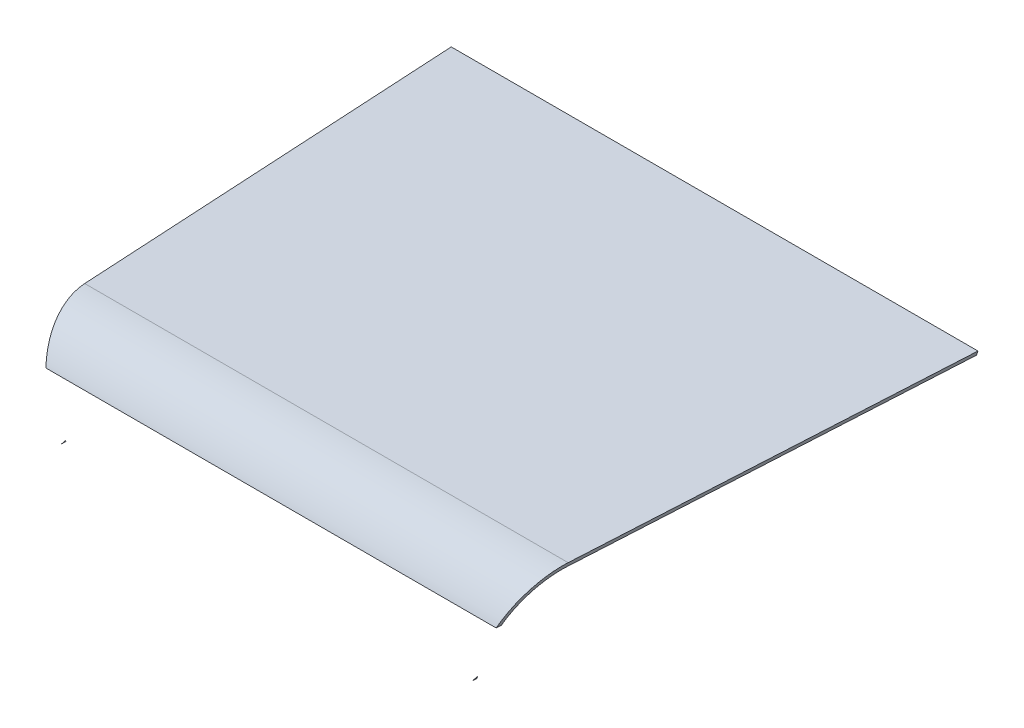
ISO-10303-21;
HEADER;
FILE_DESCRIPTION(('STEP AP214'),'2;1');
FILE_NAME('part.step','',(''),(''),'','','');
FILE_SCHEMA(('AUTOMOTIVE_DESIGN { 1 0 10303 214 1 1 1 1 }'));
ENDSEC;
DATA;
#1=APPLICATION_CONTEXT('core data for automotive mechanical design processes');
#2=APPLICATION_PROTOCOL_DEFINITION('international standard','automotive_design',2000,#1);
#3=PRODUCT_CONTEXT('',#1,'mechanical');
#4=PRODUCT('Part','Part','',(#3));
#5=PRODUCT_RELATED_PRODUCT_CATEGORY('part','',(#4));
#6=PRODUCT_DEFINITION_FORMATION('','',#4);
#7=PRODUCT_DEFINITION_CONTEXT('part definition',#1,'design');
#8=PRODUCT_DEFINITION('design','',#6,#7);
#9=PRODUCT_DEFINITION_SHAPE('','',#8);
#10=(LENGTH_UNIT() NAMED_UNIT(*) SI_UNIT(.MILLI.,.METRE.));
#11=(NAMED_UNIT(*) PLANE_ANGLE_UNIT() SI_UNIT($,.RADIAN.));
#12=(NAMED_UNIT(*) SI_UNIT($,.STERADIAN.) SOLID_ANGLE_UNIT());
#13=UNCERTAINTY_MEASURE_WITH_UNIT(LENGTH_MEASURE(1.E-05),#10,'distance_accuracy_value','');
#14=(GEOMETRIC_REPRESENTATION_CONTEXT(3) GLOBAL_UNCERTAINTY_ASSIGNED_CONTEXT((#13)) GLOBAL_UNIT_ASSIGNED_CONTEXT((#10,
#11,#12)) REPRESENTATION_CONTEXT('',''));
#15=CARTESIAN_POINT('',(0.,0.,0.));
#16=DIRECTION('',(0.,0.,1.));
#17=DIRECTION('',(1.,0.,0.));
#18=AXIS2_PLACEMENT_3D('',#15,#16,#17);
#19=CARTESIAN_POINT('',(60.4743505347116,-22.0108635312157,3.37272672467917));
#20=DIRECTION('',(-0.938404804707736,0.341551416606009,-0.0523359562429439));
#21=DIRECTION('',(-0.342020143325672,-0.939692620785907,0.));
#22=AXIS2_PLACEMENT_3D('',#19,#20,#21);
#23=PLANE('',#22);
#24=CARTESIAN_POINT('',(147.338347635043,210.,-40.));
#25=DIRECTION('',(-0.938404804707736,0.341551416606009,-0.0523359562429439));
#26=DIRECTION('',(0.345537874192446,0.927578463422807,-0.1421329366922));
#27=AXIS2_PLACEMENT_3D('',#24,#25,#26);
#28=ELLIPSE('',#27,42.6255277033219,40.);
#29=CARTESIAN_POINT('',(161.897157005691,250.,-40.0000000000001));
#30=VERTEX_POINT('',#29);
#31=CARTESIAN_POINT('',(150.752490442653,225.058565854795,-2.9427524713886));
#32=VERTEX_POINT('',#31);
#33=EDGE_CURVE('E275',#30,#32,#28,.F.);
#34=ORIENTED_EDGE('',*,*,#33,.T.);
#35=DIRECTION('',(0.0556846595471102,0.,-0.998448405623006));
#36=VECTOR('',#35,1.);
#37=CARTESIAN_POINT('',(150.121428022348,225.058565854795,8.37245125844471));
#38=LINE('',#37,#36);
#39=CARTESIAN_POINT('',(150.934316371297,225.058565854795,-6.20296470995162));
#40=VERTEX_POINT('',#39);
#41=EDGE_CURVE('E76',#32,#40,#38,.T.);
#42=ORIENTED_EDGE('',*,*,#41,.T.);
#43=CARTESIAN_POINT('',(147.338347635043,210.,-40.));
#44=DIRECTION('',(-0.938404804707736,0.341551416606009,-0.0523359562429439));
#45=DIRECTION('',(0.345537874192446,0.927578463422807,-0.1421329366922));
#46=AXIS2_PLACEMENT_3D('',#43,#44,#45);
#47=ELLIPSE('',#46,39.4286131255728,37.);
#48=CARTESIAN_POINT('',(160.805246302893,247.,-40.0000000000001));
#49=VERTEX_POINT('',#48);
#50=EDGE_CURVE('E288',#49,#40,#47,.F.);
#51=ORIENTED_EDGE('',*,*,#50,.F.);
#52=DIRECTION('',(-0.0556846595471103,0.,0.998448405623006));
#53=VECTOR('',#52,1.);
#54=CARTESIAN_POINT('',(158.082694019088,247.,8.81646056738436));
#55=LINE('',#54,#53);
#56=CARTESIAN_POINT('',(175.30575669553,247.,-300.));
#57=VERTEX_POINT('',#56);
#58=EDGE_CURVE('E134',#57,#49,#55,.T.);
#59=ORIENTED_EDGE('',*,*,#58,.F.);
#60=DIRECTION('',(0.342020143325673,0.939692620785907,0.));
#61=VECTOR('',#60,1.);
#62=CARTESIAN_POINT('',(154.231358145351,189.098565854796,-300.));
#63=LINE('',#62,#61);
#64=CARTESIAN_POINT('',(176.397667398329,250.,-300.));
#65=VERTEX_POINT('',#64);
#66=EDGE_CURVE('E127',#57,#65,#63,.T.);
#67=ORIENTED_EDGE('',*,*,#66,.T.);
#68=DIRECTION('',(-0.0556846595471103,0.,0.998448405623006));
#69=VECTOR('',#68,1.);
#70=CARTESIAN_POINT('',(176.397667398329,250.,-300.));
#71=LINE('',#70,#69);
#72=EDGE_CURVE('E131',#65,#30,#71,.T.);
#73=ORIENTED_EDGE('',*,*,#72,.T.);
#74=EDGE_LOOP('',(#34,#42,#51,#59,#67,#73));
#75=FACE_BOUND('',#74,.T.);
#76=ADVANCED_FACE('F59',(#75),#23,.F.);
#77=CARTESIAN_POINT('',(0.,0.,-300.));
#78=DIRECTION('',(0.,0.,1.));
#79=DIRECTION('',(1.,0.,0.));
#80=AXIS2_PLACEMENT_3D('',#77,#78,#79);
#81=PLANE('',#80);
#82=ORIENTED_EDGE('',*,*,#66,.F.);
#83=DIRECTION('',(-1.,0.,0.));
#84=VECTOR('',#83,1.);
#85=CARTESIAN_POINT('',(0.,247.,-300.));
#86=LINE('',#85,#84);
#87=CARTESIAN_POINT('',(-175.30575669553,247.,-300.));
#88=VERTEX_POINT('',#87);
#89=EDGE_CURVE('E153',#57,#88,#86,.T.);
#90=ORIENTED_EDGE('',*,*,#89,.T.);
#91=DIRECTION('',(0.342020143325673,-0.939692620785907,0.));
#92=VECTOR('',#91,1.);
#93=CARTESIAN_POINT('',(-176.397667398329,250.,-300.));
#94=LINE('',#93,#92);
#95=CARTESIAN_POINT('',(-176.397667398329,250.,-300.));
#96=VERTEX_POINT('',#95);
#97=EDGE_CURVE('E146',#96,#88,#94,.T.);
#98=ORIENTED_EDGE('',*,*,#97,.F.);
#99=DIRECTION('',(-1.,0.,0.));
#100=VECTOR('',#99,1.);
#101=CARTESIAN_POINT('',(176.397667398329,250.,-300.));
#102=LINE('',#101,#100);
#103=EDGE_CURVE('E142',#65,#96,#102,.T.);
#104=ORIENTED_EDGE('',*,*,#103,.F.);
#105=EDGE_LOOP('',(#82,#90,#98,#104));
#106=FACE_BOUND('',#105,.T.);
#107=ADVANCED_FACE('F144',(#106),#81,.F.);
#108=CARTESIAN_POINT('',(-60.4743505347116,-22.0108635312157,3.37272672467917));
#109=DIRECTION('',(0.938404804707736,0.341551416606009,-0.0523359562429439));
#110=DIRECTION('',(-0.342020143325672,0.939692620785907,0.));
#111=AXIS2_PLACEMENT_3D('',#108,#109,#110);
#112=PLANE('',#111);
#113=CARTESIAN_POINT('',(-147.338347635043,210.,-40.));
#114=DIRECTION('',(0.938404804707736,0.341551416606009,-0.0523359562429439));
#115=DIRECTION('',(0.345537874192446,-0.927578463422807,0.1421329366922));
#116=AXIS2_PLACEMENT_3D('',#113,#114,#115);
#117=ELLIPSE('',#116,39.4286131255728,37.);
#118=CARTESIAN_POINT('',(-150.934316371297,225.058565854795,-6.20296470995162));
#119=VERTEX_POINT('',#118);
#120=CARTESIAN_POINT('',(-160.805246302893,247.,-40.0000000000001));
#121=VERTEX_POINT('',#120);
#122=EDGE_CURVE('E287',#119,#121,#117,.F.);
#123=ORIENTED_EDGE('',*,*,#122,.F.);
#124=DIRECTION('',(0.0556846595471102,0.,0.998448405623006));
#125=VECTOR('',#124,1.);
#126=CARTESIAN_POINT('',(-150.121428022348,225.058565854795,8.3724512584447));
#127=LINE('',#126,#125);
#128=CARTESIAN_POINT('',(-150.752490442653,225.058565854795,-2.94275247138857));
#129=VERTEX_POINT('',#128);
#130=EDGE_CURVE('E63',#119,#129,#127,.T.);
#131=ORIENTED_EDGE('',*,*,#130,.T.);
#132=CARTESIAN_POINT('',(-147.338347635043,210.,-40.));
#133=DIRECTION('',(0.938404804707736,0.341551416606009,-0.0523359562429439));
#134=DIRECTION('',(0.345537874192446,-0.927578463422807,0.1421329366922));
#135=AXIS2_PLACEMENT_3D('',#132,#133,#134);
#136=ELLIPSE('',#135,42.6255277033219,40.);
#137=CARTESIAN_POINT('',(-161.897157005691,250.,-40.0000000000001));
#138=VERTEX_POINT('',#137);
#139=EDGE_CURVE('E122',#129,#138,#136,.F.);
#140=ORIENTED_EDGE('',*,*,#139,.T.);
#141=DIRECTION('',(0.0556846595471103,0.,0.998448405623006));
#142=VECTOR('',#141,1.);
#143=CARTESIAN_POINT('',(-176.397667398329,250.,-300.));
#144=LINE('',#143,#142);
#145=EDGE_CURVE('E280',#96,#138,#144,.T.);
#146=ORIENTED_EDGE('',*,*,#145,.F.);
#147=ORIENTED_EDGE('',*,*,#97,.T.);
#148=DIRECTION('',(0.0556846595471103,0.,0.998448405623006));
#149=VECTOR('',#148,1.);
#150=CARTESIAN_POINT('',(-158.082694019088,247.,8.81646056738437));
#151=LINE('',#150,#149);
#152=EDGE_CURVE('E105',#88,#121,#151,.T.);
#153=ORIENTED_EDGE('',*,*,#152,.T.);
#154=EDGE_LOOP('',(#123,#131,#140,#146,#147,#153));
#155=FACE_BOUND('',#154,.T.);
#156=ADVANCED_FACE('F174',(#155),#112,.F.);
#157=CARTESIAN_POINT('',(0.,250.,0.));
#158=DIRECTION('',(0.,-1.,0.));
#159=DIRECTION('',(0.,0.,-1.));
#160=AXIS2_PLACEMENT_3D('',#157,#158,#159);
#161=PLANE('',#160);
#162=ORIENTED_EDGE('',*,*,#145,.T.);
#163=DIRECTION('',(-1.,0.,0.));
#164=VECTOR('',#163,1.);
#165=CARTESIAN_POINT('',(159.666309252978,250.,-40.));
#166=LINE('',#165,#164);
#167=EDGE_CURVE('E114',#138,#30,#166,.F.);
#168=ORIENTED_EDGE('',*,*,#167,.T.);
#169=ORIENTED_EDGE('',*,*,#72,.F.);
#170=ORIENTED_EDGE('',*,*,#103,.T.);
#171=EDGE_LOOP('',(#162,#168,#169,#170));
#172=FACE_BOUND('',#171,.T.);
#173=ADVANCED_FACE('F152',(#172),#161,.F.);
#174=CARTESIAN_POINT('',(0.,210.,-40.));
#175=DIRECTION('',(1.,0.,0.));
#176=DIRECTION('',(0.,0.,-1.));
#177=AXIS2_PLACEMENT_3D('',#174,#175,#176);
#178=CYLINDRICAL_SURFACE('',#177,40.);
#179=DIRECTION('',(1.,0.,0.));
#180=VECTOR('',#179,1.);
#181=CARTESIAN_POINT('',(0.,225.058565854795,-2.94275247138859));
#182=LINE('',#181,#180);
#183=EDGE_CURVE('E13',#32,#129,#182,.F.);
#184=ORIENTED_EDGE('',*,*,#183,.F.);
#185=ORIENTED_EDGE('',*,*,#33,.F.);
#186=ORIENTED_EDGE('',*,*,#167,.F.);
#187=ORIENTED_EDGE('',*,*,#139,.F.);
#188=EDGE_LOOP('',(#184,#185,#186,#187));
#189=FACE_BOUND('',#188,.T.);
#190=ADVANCED_FACE('F173',(#189),#178,.T.);
#191=CARTESIAN_POINT('',(0.,247.,0.));
#192=DIRECTION('',(0.,-1.,0.));
#193=DIRECTION('',(0.,0.,-1.));
#194=AXIS2_PLACEMENT_3D('',#191,#192,#193);
#195=PLANE('',#194);
#196=ORIENTED_EDGE('',*,*,#152,.F.);
#197=ORIENTED_EDGE('',*,*,#89,.F.);
#198=ORIENTED_EDGE('',*,*,#58,.T.);
#199=DIRECTION('',(1.,0.,0.));
#200=VECTOR('',#199,1.);
#201=CARTESIAN_POINT('',(0.,247.,-40.0000000000001));
#202=LINE('',#201,#200);
#203=EDGE_CURVE('E69',#121,#49,#202,.T.);
#204=ORIENTED_EDGE('',*,*,#203,.F.);
#205=EDGE_LOOP('',(#196,#197,#198,#204));
#206=FACE_BOUND('',#205,.T.);
#207=ADVANCED_FACE('F221',(#206),#195,.T.);
#208=CARTESIAN_POINT('',(0.,210.,-40.));
#209=DIRECTION('',(1.,0.,0.));
#210=DIRECTION('',(0.,0.,-1.));
#211=AXIS2_PLACEMENT_3D('',#208,#209,#210);
#212=CYLINDRICAL_SURFACE('',#211,37.);
#213=ORIENTED_EDGE('',*,*,#50,.T.);
#214=DIRECTION('',(1.,0.,0.));
#215=VECTOR('',#214,1.);
#216=CARTESIAN_POINT('',(0.,225.058565854795,-6.20296470995162));
#217=LINE('',#216,#215);
#218=EDGE_CURVE('E285',#40,#119,#217,.F.);
#219=ORIENTED_EDGE('',*,*,#218,.T.);
#220=ORIENTED_EDGE('',*,*,#122,.T.);
#221=ORIENTED_EDGE('',*,*,#203,.T.);
#222=EDGE_LOOP('',(#213,#219,#220,#221));
#223=FACE_BOUND('',#222,.T.);
#224=ADVANCED_FACE('F178',(#223),#212,.F.);
#225=CARTESIAN_POINT('',(154.249008644006,225.058565854795,-30.));
#226=DIRECTION('',(0.,1.,0.));
#227=DIRECTION('',(-1.,0.,0.));
#228=AXIS2_PLACEMENT_3D('',#225,#226,#227);
#229=PLANE('',#228);
#230=ORIENTED_EDGE('',*,*,#183,.T.);
#231=ORIENTED_EDGE('',*,*,#130,.F.);
#232=ORIENTED_EDGE('',*,*,#218,.F.);
#233=ORIENTED_EDGE('',*,*,#41,.F.);
#234=EDGE_LOOP('',(#230,#231,#232,#233));
#235=FACE_BOUND('',#234,.T.);
#236=ADVANCED_FACE('F219',(#235),#229,.F.);
#237=CLOSED_SHELL('',(#76,#107,#156,#173,#190,#207,#224,#236));
#238=MANIFOLD_SOLID_BREP('B2',#237);
#239=CARTESIAN_POINT('',(0.,0.,-3.));
#240=DIRECTION('',(0.,0.,1.));
#241=DIRECTION('',(1.,0.,0.));
#242=AXIS2_PLACEMENT_3D('',#239,#240,#241);
#243=PLANE('',#242);
#244=DIRECTION('',(1.,0.,0.));
#245=VECTOR('',#244,1.);
#246=CARTESIAN_POINT('',(0.,189.098565854795,-3.));
#247=LINE('',#246,#245);
#248=CARTESIAN_POINT('',(137.5,189.098565854795,-3.));
#249=VERTEX_POINT('',#248);
#250=CARTESIAN_POINT('',(137.667313581453,189.098565854795,-3.));
#251=VERTEX_POINT('',#250);
#252=EDGE_CURVE('E327',#249,#251,#247,.T.);
#253=ORIENTED_EDGE('',*,*,#252,.F.);
#254=DIRECTION('',(0.422216217551027,0.906495154778504,0.));
#255=VECTOR('',#254,1.);
#256=CARTESIAN_POINT('',(40.6133421443811,-18.9163853903844,-3.));
#257=LINE('',#256,#255);
#258=CARTESIAN_POINT('',(138.26553208521,190.742157685767,-3.));
#259=VERTEX_POINT('',#258);
#260=EDGE_CURVE('E345',#249,#259,#257,.T.);
#261=ORIENTED_EDGE('',*,*,#260,.T.);
#262=DIRECTION('',(0.342020143325672,0.939692620785907,0.));
#263=VECTOR('',#262,1.);
#264=CARTESIAN_POINT('',(60.7881895043427,-22.1250915745142,-3.));
#265=LINE('',#264,#263);
#266=EDGE_CURVE('E357',#251,#259,#265,.T.);
#267=ORIENTED_EDGE('',*,*,#266,.F.);
#268=EDGE_LOOP('',(#253,#261,#267));
#269=FACE_BOUND('',#268,.T.);
#270=ADVANCED_FACE('F323',(#269),#243,.F.);
#271=CARTESIAN_POINT('',(0.,189.098565854795,0.));
#272=DIRECTION('',(0.,1.,0.));
#273=DIRECTION('',(0.,0.,1.));
#274=AXIS2_PLACEMENT_3D('',#271,#272,#273);
#275=PLANE('',#274);
#276=DIRECTION('',(-0.0556846595471102,0.,0.998448405623006));
#277=VECTOR('',#276,1.);
#278=CARTESIAN_POINT('',(154.231358145351,189.098565854796,-300.));
#279=LINE('',#278,#277);
#280=CARTESIAN_POINT('',(137.5,189.098565854795,0.));
#281=VERTEX_POINT('',#280);
#282=EDGE_CURVE('E352',#251,#281,#279,.T.);
#283=ORIENTED_EDGE('',*,*,#282,.T.);
#284=DIRECTION('',(0.,0.,1.));
#285=VECTOR('',#284,1.);
#286=CARTESIAN_POINT('',(137.5,189.098565854795,-30.));
#287=LINE('',#286,#285);
#288=EDGE_CURVE('E57',#249,#281,#287,.T.);
#289=ORIENTED_EDGE('',*,*,#288,.F.);
#290=ORIENTED_EDGE('',*,*,#252,.T.);
#291=EDGE_LOOP('',(#283,#289,#290));
#292=FACE_BOUND('',#291,.T.);
#293=ADVANCED_FACE('F325',(#292),#275,.F.);
#294=CARTESIAN_POINT('',(60.4743505347116,-22.0108635312157,3.37272672467917));
#295=DIRECTION('',(-0.938404804707736,0.341551416606009,-0.0523359562429439));
#296=DIRECTION('',(-0.342020143325672,-0.939692620785907,0.));
#297=AXIS2_PLACEMENT_3D('',#294,#295,#296);
#298=PLANE('',#297);
#299=ORIENTED_EDGE('',*,*,#266,.T.);
#300=DIRECTION('',(-0.218390029935287,-0.468881809269547,0.85583622484736));
#301=VECTOR('',#300,1.);
#302=CARTESIAN_POINT('',(111.578521495868,133.445339635813,101.582202777351));
#303=LINE('',#302,#301);
#304=EDGE_CURVE('E333',#259,#281,#303,.T.);
#305=ORIENTED_EDGE('',*,*,#304,.T.);
#306=ORIENTED_EDGE('',*,*,#282,.F.);
#307=EDGE_LOOP('',(#299,#305,#306));
#308=FACE_BOUND('',#307,.T.);
#309=ADVANCED_FACE('F367',(#308),#298,.F.);
#310=CARTESIAN_POINT('',(137.5,189.098565854795,-30.));
#311=DIRECTION('',(0.906495154778504,-0.422216217551027,0.));
#312=DIRECTION('',(0.422216217551027,0.906495154778504,0.));
#313=AXIS2_PLACEMENT_3D('',#310,#311,#312);
#314=PLANE('',#313);
#315=ORIENTED_EDGE('',*,*,#260,.F.);
#316=ORIENTED_EDGE('',*,*,#288,.T.);
#317=ORIENTED_EDGE('',*,*,#304,.F.);
#318=EDGE_LOOP('',(#315,#316,#317));
#319=FACE_BOUND('',#318,.T.);
#320=ADVANCED_FACE('F347',(#319),#314,.F.);
#321=CLOSED_SHELL('',(#270,#293,#309,#320));
#322=MANIFOLD_SOLID_BREP('B7',#321);
#323=CARTESIAN_POINT('',(0.,0.,-3.));
#324=DIRECTION('',(0.,0.,1.));
#325=DIRECTION('',(1.,0.,0.));
#326=AXIS2_PLACEMENT_3D('',#323,#324,#325);
#327=PLANE('',#326);
#328=DIRECTION('',(0.342020143325672,-0.939692620785907,0.));
#329=VECTOR('',#328,1.);
#330=CARTESIAN_POINT('',(-60.7881895043427,-22.1250915745142,-3.));
#331=LINE('',#330,#329);
#332=CARTESIAN_POINT('',(-137.815443281224,189.505548860064,-3.));
#333=VERTEX_POINT('',#332);
#334=CARTESIAN_POINT('',(-137.667313581453,189.098565854795,-3.));
#335=VERTEX_POINT('',#334);
#336=EDGE_CURVE('E422',#333,#335,#331,.T.);
#337=ORIENTED_EDGE('',*,*,#336,.F.);
#338=DIRECTION('',(0.612609826032816,-0.790385476238047,0.));
#339=VECTOR('',#338,1.);
#340=CARTESIAN_POINT('',(5.66361505603746,4.38973935947044,-3.));
#341=LINE('',#340,#339);
#342=CARTESIAN_POINT('',(-137.5,189.098565854795,-3.));
#343=VERTEX_POINT('',#342);
#344=EDGE_CURVE('E321',#333,#343,#341,.T.);
#345=ORIENTED_EDGE('',*,*,#344,.T.);
#346=DIRECTION('',(1.,0.,0.));
#347=VECTOR('',#346,1.);
#348=CARTESIAN_POINT('',(0.,189.098565854795,-3.));
#349=LINE('',#348,#347);
#350=EDGE_CURVE('E433',#335,#343,#349,.T.);
#351=ORIENTED_EDGE('',*,*,#350,.F.);
#352=EDGE_LOOP('',(#337,#345,#351));
#353=FACE_BOUND('',#352,.T.);
#354=ADVANCED_FACE('F400',(#353),#327,.F.);
#355=CARTESIAN_POINT('',(0.,189.098565854795,0.));
#356=DIRECTION('',(0.,1.,0.));
#357=DIRECTION('',(0.,0.,1.));
#358=AXIS2_PLACEMENT_3D('',#355,#356,#357);
#359=PLANE('',#358);
#360=ORIENTED_EDGE('',*,*,#350,.T.);
#361=DIRECTION('',(0.,0.,1.));
#362=VECTOR('',#361,1.);
#363=CARTESIAN_POINT('',(-137.5,189.098565854795,-30.));
#364=LINE('',#363,#362);
#365=CARTESIAN_POINT('',(-137.5,189.098565854795,0.));
#366=VERTEX_POINT('',#365);
#367=EDGE_CURVE('E415',#343,#366,#364,.T.);
#368=ORIENTED_EDGE('',*,*,#367,.T.);
#369=DIRECTION('',(0.0556846595471103,0.,0.998448405623006));
#370=VECTOR('',#369,1.);
#371=CARTESIAN_POINT('',(-154.231358145351,189.098565854796,-300.));
#372=LINE('',#371,#370);
#373=EDGE_CURVE('E408',#335,#366,#372,.T.);
#374=ORIENTED_EDGE('',*,*,#373,.F.);
#375=EDGE_LOOP('',(#360,#368,#374));
#376=FACE_BOUND('',#375,.T.);
#377=ADVANCED_FACE('F402',(#376),#359,.F.);
#378=CARTESIAN_POINT('',(-60.4743505347116,-22.0108635312157,3.37272672467917));
#379=DIRECTION('',(0.938404804707736,0.341551416606009,-0.0523359562429439));
#380=DIRECTION('',(-0.342020143325672,0.939692620785907,0.));
#381=AXIS2_PLACEMENT_3D('',#378,#379,#380);
#382=PLANE('',#381);
#383=ORIENTED_EDGE('',*,*,#373,.T.);
#384=DIRECTION('',(-0.103632338250645,0.133705813294464,-0.985587689634956));
#385=VECTOR('',#384,1.);
#386=CARTESIAN_POINT('',(-133.40310027959,183.812770722215,38.96326183762));
#387=LINE('',#386,#385);
#388=EDGE_CURVE('E427',#366,#333,#387,.T.);
#389=ORIENTED_EDGE('',*,*,#388,.T.);
#390=ORIENTED_EDGE('',*,*,#336,.T.);
#391=EDGE_LOOP('',(#383,#389,#390));
#392=FACE_BOUND('',#391,.T.);
#393=ADVANCED_FACE('F435',(#392),#382,.F.);
#394=CARTESIAN_POINT('',(-165.371779032419,225.058565854795,-30.));
#395=DIRECTION('',(-0.790385476238046,-0.612609826032815,0.));
#396=DIRECTION('',(0.612609826032816,-0.790385476238047,0.));
#397=AXIS2_PLACEMENT_3D('',#394,#395,#396);
#398=PLANE('',#397);
#399=ORIENTED_EDGE('',*,*,#367,.F.);
#400=ORIENTED_EDGE('',*,*,#344,.F.);
#401=ORIENTED_EDGE('',*,*,#388,.F.);
#402=EDGE_LOOP('',(#399,#400,#401));
#403=FACE_BOUND('',#402,.T.);
#404=ADVANCED_FACE('F428',(#403),#398,.F.);
#405=CLOSED_SHELL('',(#354,#377,#393,#404));
#406=MANIFOLD_SOLID_BREP('B51',#405);
#407=ADVANCED_BREP_SHAPE_REPRESENTATION('',(#18,#238,#322,#406),#14);
#408=SHAPE_DEFINITION_REPRESENTATION(#9,#407);
ENDSEC;
END-ISO-10303-21;
